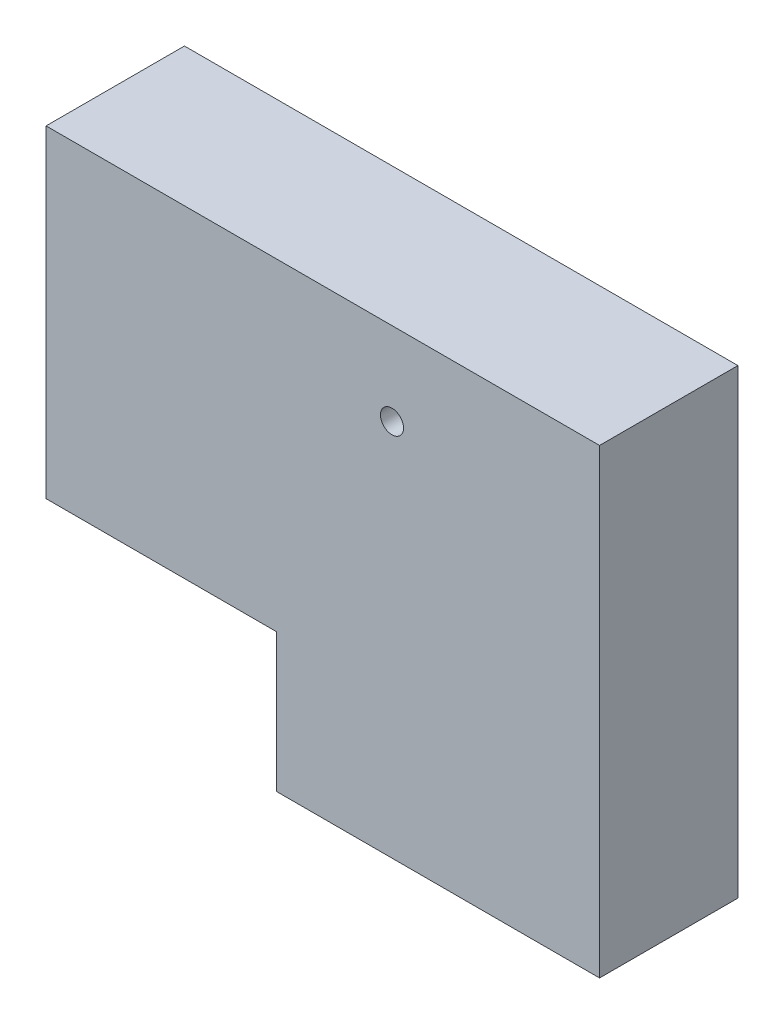
ISO-10303-21;
HEADER;
FILE_DESCRIPTION(('STEP AP214'),'2;1');
FILE_NAME('part.step','',(''),(''),'','','');
FILE_SCHEMA(('AUTOMOTIVE_DESIGN { 1 0 10303 214 1 1 1 1 }'));
ENDSEC;
DATA;
#1=APPLICATION_CONTEXT('core data for automotive mechanical design processes');
#2=APPLICATION_PROTOCOL_DEFINITION('international standard','automotive_design',2000,#1);
#3=PRODUCT_CONTEXT('',#1,'mechanical');
#4=PRODUCT('Part','Part','',(#3));
#5=PRODUCT_RELATED_PRODUCT_CATEGORY('part','',(#4));
#6=PRODUCT_DEFINITION_FORMATION('','',#4);
#7=PRODUCT_DEFINITION_CONTEXT('part definition',#1,'design');
#8=PRODUCT_DEFINITION('design','',#6,#7);
#9=PRODUCT_DEFINITION_SHAPE('','',#8);
#10=(LENGTH_UNIT() NAMED_UNIT(*) SI_UNIT(.MILLI.,.METRE.));
#11=(NAMED_UNIT(*) PLANE_ANGLE_UNIT() SI_UNIT($,.RADIAN.));
#12=(NAMED_UNIT(*) SI_UNIT($,.STERADIAN.) SOLID_ANGLE_UNIT());
#13=UNCERTAINTY_MEASURE_WITH_UNIT(LENGTH_MEASURE(1.E-05),#10,'distance_accuracy_value','');
#14=(GEOMETRIC_REPRESENTATION_CONTEXT(3) GLOBAL_UNCERTAINTY_ASSIGNED_CONTEXT((#13)) GLOBAL_UNIT_ASSIGNED_CONTEXT((#10,
#11,#12)) REPRESENTATION_CONTEXT('',''));
#15=CARTESIAN_POINT('',(0.,0.,0.));
#16=DIRECTION('',(0.,0.,1.));
#17=DIRECTION('',(1.,0.,0.));
#18=AXIS2_PLACEMENT_3D('',#15,#16,#17);
#19=CARTESIAN_POINT('',(-120.,0.,30.));
#20=DIRECTION('',(1.,0.,0.));
#21=DIRECTION('',(0.,1.,0.));
#22=AXIS2_PLACEMENT_3D('',#19,#20,#21);
#23=PLANE('',#22);
#24=DIRECTION('',(0.,-1.,0.));
#25=VECTOR('',#24,1.);
#26=CARTESIAN_POINT('',(-120.,0.,0.));
#27=LINE('',#26,#25);
#28=CARTESIAN_POINT('',(-120.,0.,0.));
#29=VERTEX_POINT('',#28);
#30=CARTESIAN_POINT('',(-120.,-70.,0.));
#31=VERTEX_POINT('',#30);
#32=EDGE_CURVE('E125',#29,#31,#27,.T.);
#33=ORIENTED_EDGE('',*,*,#32,.T.);
#34=DIRECTION('',(0.,0.,-1.));
#35=VECTOR('',#34,1.);
#36=CARTESIAN_POINT('',(-120.,-70.,30.));
#37=LINE('',#36,#35);
#38=CARTESIAN_POINT('',(-120.,-70.,30.));
#39=VERTEX_POINT('',#38);
#40=EDGE_CURVE('E11',#39,#31,#37,.T.);
#41=ORIENTED_EDGE('',*,*,#40,.F.);
#42=DIRECTION('',(0.,-1.,0.));
#43=VECTOR('',#42,1.);
#44=CARTESIAN_POINT('',(-120.,0.,30.));
#45=LINE('',#44,#43);
#46=CARTESIAN_POINT('',(-120.,0.,30.));
#47=VERTEX_POINT('',#46);
#48=EDGE_CURVE('E136',#47,#39,#45,.T.);
#49=ORIENTED_EDGE('',*,*,#48,.F.);
#50=DIRECTION('',(0.,0.,-1.));
#51=VECTOR('',#50,1.);
#52=CARTESIAN_POINT('',(-120.,0.,30.));
#53=LINE('',#52,#51);
#54=EDGE_CURVE('E121',#47,#29,#53,.T.);
#55=ORIENTED_EDGE('',*,*,#54,.T.);
#56=EDGE_LOOP('',(#33,#41,#49,#55));
#57=FACE_BOUND('',#56,.T.);
#58=ADVANCED_FACE('F39',(#57),#23,.F.);
#59=CARTESIAN_POINT('',(-120.,-70.,30.));
#60=DIRECTION('',(0.,1.,0.));
#61=DIRECTION('',(0.,0.,1.));
#62=AXIS2_PLACEMENT_3D('',#59,#60,#61);
#63=PLANE('',#62);
#64=DIRECTION('',(1.,0.,0.));
#65=VECTOR('',#64,1.);
#66=CARTESIAN_POINT('',(-120.,-70.,0.));
#67=LINE('',#66,#65);
#68=CARTESIAN_POINT('',(-70.,-70.,0.));
#69=VERTEX_POINT('',#68);
#70=EDGE_CURVE('E128',#31,#69,#67,.T.);
#71=ORIENTED_EDGE('',*,*,#70,.T.);
#72=DIRECTION('',(0.,0.,-1.));
#73=VECTOR('',#72,1.);
#74=CARTESIAN_POINT('',(-70.,-70.,30.));
#75=LINE('',#74,#73);
#76=CARTESIAN_POINT('',(-70.,-70.,30.));
#77=VERTEX_POINT('',#76);
#78=EDGE_CURVE('E47',#77,#69,#75,.T.);
#79=ORIENTED_EDGE('',*,*,#78,.F.);
#80=DIRECTION('',(1.,0.,0.));
#81=VECTOR('',#80,1.);
#82=CARTESIAN_POINT('',(-120.,-70.,30.));
#83=LINE('',#82,#81);
#84=EDGE_CURVE('E93',#39,#77,#83,.T.);
#85=ORIENTED_EDGE('',*,*,#84,.F.);
#86=ORIENTED_EDGE('',*,*,#40,.T.);
#87=EDGE_LOOP('',(#71,#79,#85,#86));
#88=FACE_BOUND('',#87,.T.);
#89=ADVANCED_FACE('F161',(#88),#63,.F.);
#90=CARTESIAN_POINT('',(-70.,-70.,30.));
#91=DIRECTION('',(1.,0.,0.));
#92=DIRECTION('',(0.,0.,-1.));
#93=AXIS2_PLACEMENT_3D('',#90,#91,#92);
#94=PLANE('',#93);
#95=DIRECTION('',(0.,-1.,0.));
#96=VECTOR('',#95,1.);
#97=CARTESIAN_POINT('',(-70.,-70.,0.));
#98=LINE('',#97,#96);
#99=CARTESIAN_POINT('',(-70.,-100.,0.));
#100=VERTEX_POINT('',#99);
#101=EDGE_CURVE('E131',#69,#100,#98,.T.);
#102=ORIENTED_EDGE('',*,*,#101,.T.);
#103=DIRECTION('',(0.,0.,-1.));
#104=VECTOR('',#103,1.);
#105=CARTESIAN_POINT('',(-70.,-100.,30.));
#106=LINE('',#105,#104);
#107=CARTESIAN_POINT('',(-70.,-100.,30.));
#108=VERTEX_POINT('',#107);
#109=EDGE_CURVE('E116',#108,#100,#106,.T.);
#110=ORIENTED_EDGE('',*,*,#109,.F.);
#111=DIRECTION('',(0.,-1.,0.));
#112=VECTOR('',#111,1.);
#113=CARTESIAN_POINT('',(-70.,-70.,30.));
#114=LINE('',#113,#112);
#115=EDGE_CURVE('E107',#77,#108,#114,.T.);
#116=ORIENTED_EDGE('',*,*,#115,.F.);
#117=ORIENTED_EDGE('',*,*,#78,.T.);
#118=EDGE_LOOP('',(#102,#110,#116,#117));
#119=FACE_BOUND('',#118,.T.);
#120=ADVANCED_FACE('F142',(#119),#94,.F.);
#121=CARTESIAN_POINT('',(-70.,-100.,30.));
#122=DIRECTION('',(0.,1.,0.));
#123=DIRECTION('',(0.,0.,1.));
#124=AXIS2_PLACEMENT_3D('',#121,#122,#123);
#125=PLANE('',#124);
#126=DIRECTION('',(1.,0.,0.));
#127=VECTOR('',#126,1.);
#128=CARTESIAN_POINT('',(-70.,-100.,0.));
#129=LINE('',#128,#127);
#130=CARTESIAN_POINT('',(0.,-100.,0.));
#131=VERTEX_POINT('',#130);
#132=EDGE_CURVE('E115',#100,#131,#129,.T.);
#133=ORIENTED_EDGE('',*,*,#132,.T.);
#134=DIRECTION('',(0.,0.,-1.));
#135=VECTOR('',#134,1.);
#136=CARTESIAN_POINT('',(0.,-100.,30.));
#137=LINE('',#136,#135);
#138=CARTESIAN_POINT('',(0.,-100.,30.));
#139=VERTEX_POINT('',#138);
#140=EDGE_CURVE('E112',#139,#131,#137,.T.);
#141=ORIENTED_EDGE('',*,*,#140,.F.);
#142=DIRECTION('',(1.,0.,0.));
#143=VECTOR('',#142,1.);
#144=CARTESIAN_POINT('',(-70.,-100.,30.));
#145=LINE('',#144,#143);
#146=EDGE_CURVE('E101',#108,#139,#145,.T.);
#147=ORIENTED_EDGE('',*,*,#146,.F.);
#148=ORIENTED_EDGE('',*,*,#109,.T.);
#149=EDGE_LOOP('',(#133,#141,#147,#148));
#150=FACE_BOUND('',#149,.T.);
#151=ADVANCED_FACE('F113',(#150),#125,.F.);
#152=CARTESIAN_POINT('',(0.,0.,30.));
#153=DIRECTION('',(-1.,0.,0.));
#154=DIRECTION('',(0.,-1.,0.));
#155=AXIS2_PLACEMENT_3D('',#152,#153,#154);
#156=PLANE('',#155);
#157=DIRECTION('',(0.,1.,0.));
#158=VECTOR('',#157,1.);
#159=CARTESIAN_POINT('',(0.,0.,0.));
#160=LINE('',#159,#158);
#161=CARTESIAN_POINT('',(0.,0.,0.));
#162=VERTEX_POINT('',#161);
#163=EDGE_CURVE('E79',#131,#162,#160,.T.);
#164=ORIENTED_EDGE('',*,*,#163,.T.);
#165=DIRECTION('',(0.,0.,-1.));
#166=VECTOR('',#165,1.);
#167=CARTESIAN_POINT('',(0.,0.,30.));
#168=LINE('',#167,#166);
#169=CARTESIAN_POINT('',(0.,0.,30.));
#170=VERTEX_POINT('',#169);
#171=EDGE_CURVE('E117',#170,#162,#168,.T.);
#172=ORIENTED_EDGE('',*,*,#171,.F.);
#173=DIRECTION('',(0.,1.,0.));
#174=VECTOR('',#173,1.);
#175=CARTESIAN_POINT('',(0.,0.,30.));
#176=LINE('',#175,#174);
#177=EDGE_CURVE('E105',#139,#170,#176,.T.);
#178=ORIENTED_EDGE('',*,*,#177,.F.);
#179=ORIENTED_EDGE('',*,*,#140,.T.);
#180=EDGE_LOOP('',(#164,#172,#178,#179));
#181=FACE_BOUND('',#180,.T.);
#182=ADVANCED_FACE('F119',(#181),#156,.F.);
#183=CARTESIAN_POINT('',(-120.,0.,30.));
#184=DIRECTION('',(0.,-1.,0.));
#185=DIRECTION('',(0.,0.,-1.));
#186=AXIS2_PLACEMENT_3D('',#183,#184,#185);
#187=PLANE('',#186);
#188=DIRECTION('',(-1.,0.,0.));
#189=VECTOR('',#188,1.);
#190=CARTESIAN_POINT('',(-120.,0.,0.));
#191=LINE('',#190,#189);
#192=EDGE_CURVE('E85',#162,#29,#191,.T.);
#193=ORIENTED_EDGE('',*,*,#192,.T.);
#194=ORIENTED_EDGE('',*,*,#54,.F.);
#195=DIRECTION('',(-1.,0.,0.));
#196=VECTOR('',#195,1.);
#197=CARTESIAN_POINT('',(-120.,0.,30.));
#198=LINE('',#197,#196);
#199=EDGE_CURVE('E55',#170,#47,#198,.T.);
#200=ORIENTED_EDGE('',*,*,#199,.F.);
#201=ORIENTED_EDGE('',*,*,#171,.T.);
#202=EDGE_LOOP('',(#193,#194,#200,#201));
#203=FACE_BOUND('',#202,.T.);
#204=ADVANCED_FACE('F149',(#203),#187,.F.);
#205=CARTESIAN_POINT('',(0.,0.,30.));
#206=DIRECTION('',(0.,0.,1.));
#207=DIRECTION('',(1.,0.,0.));
#208=AXIS2_PLACEMENT_3D('',#205,#206,#207);
#209=PLANE('',#208);
#210=CARTESIAN_POINT('',(-45.,-18.,30.));
#211=DIRECTION('',(0.,0.,1.));
#212=DIRECTION('',(1.,0.,0.));
#213=AXIS2_PLACEMENT_3D('',#210,#211,#212);
#214=CIRCLE('',#213,2.5);
#215=CARTESIAN_POINT('',(-42.5,-18.,30.));
#216=VERTEX_POINT('',#215);
#217=EDGE_CURVE('E229',#216,#216,#214,.T.);
#218=ORIENTED_EDGE('',*,*,#217,.F.);
#219=EDGE_LOOP('',(#218));
#220=FACE_BOUND('',#219,.T.);
#221=ORIENTED_EDGE('',*,*,#48,.T.);
#222=ORIENTED_EDGE('',*,*,#84,.T.);
#223=ORIENTED_EDGE('',*,*,#115,.T.);
#224=ORIENTED_EDGE('',*,*,#146,.T.);
#225=ORIENTED_EDGE('',*,*,#177,.T.);
#226=ORIENTED_EDGE('',*,*,#199,.T.);
#227=EDGE_LOOP('',(#221,#222,#223,#224,#225,#226));
#228=FACE_BOUND('',#227,.T.);
#229=ADVANCED_FACE('F103',(#220,#228),#209,.T.);
#230=CARTESIAN_POINT('',(0.,0.,0.));
#231=DIRECTION('',(0.,0.,1.));
#232=DIRECTION('',(1.,0.,0.));
#233=AXIS2_PLACEMENT_3D('',#230,#231,#232);
#234=PLANE('',#233);
#235=ORIENTED_EDGE('',*,*,#32,.F.);
#236=ORIENTED_EDGE('',*,*,#192,.F.);
#237=ORIENTED_EDGE('',*,*,#163,.F.);
#238=ORIENTED_EDGE('',*,*,#132,.F.);
#239=ORIENTED_EDGE('',*,*,#101,.F.);
#240=ORIENTED_EDGE('',*,*,#70,.F.);
#241=EDGE_LOOP('',(#235,#236,#237,#238,#239,#240));
#242=FACE_BOUND('',#241,.T.);
#243=ADVANCED_FACE('F145',(#242),#234,.F.);
#244=CARTESIAN_POINT('',(-45.,-18.,21.));
#245=DIRECTION('',(0.,0.,1.));
#246=DIRECTION('',(1.,0.,0.));
#247=AXIS2_PLACEMENT_3D('',#244,#245,#246);
#248=CONICAL_SURFACE('',#247,2.5,1.02974425867665);
#249=CARTESIAN_POINT('',(-45.,-18.,19.4978484524311));
#250=VERTEX_POINT('',#249);
#251=VERTEX_LOOP('',#250);
#252=FACE_BOUND('',#251,.T.);
#253=CARTESIAN_POINT('',(-45.,-18.,21.));
#254=DIRECTION('',(0.,0.,1.));
#255=DIRECTION('',(1.,0.,0.));
#256=AXIS2_PLACEMENT_3D('',#253,#254,#255);
#257=CIRCLE('',#256,2.5);
#258=CARTESIAN_POINT('',(-42.5,-18.,21.));
#259=VERTEX_POINT('',#258);
#260=EDGE_CURVE('E129',#259,#259,#257,.T.);
#261=ORIENTED_EDGE('',*,*,#260,.T.);
#262=EDGE_LOOP('',(#261));
#263=FACE_BOUND('',#262,.T.);
#264=ADVANCED_FACE('F193',(#252,#263),#248,.F.);
#265=CARTESIAN_POINT('',(-45.,-18.,30.));
#266=DIRECTION('',(0.,0.,1.));
#267=DIRECTION('',(1.,0.,0.));
#268=AXIS2_PLACEMENT_3D('',#265,#266,#267);
#269=CYLINDRICAL_SURFACE('',#268,2.5);
#270=ORIENTED_EDGE('',*,*,#260,.F.);
#271=EDGE_LOOP('',(#270));
#272=FACE_BOUND('',#271,.T.);
#273=ORIENTED_EDGE('',*,*,#217,.T.);
#274=EDGE_LOOP('',(#273));
#275=FACE_BOUND('',#274,.T.);
#276=ADVANCED_FACE('F206',(#272,#275),#269,.F.);
#277=CLOSED_SHELL('',(#58,#89,#120,#151,#182,#204,#229,#243,#264,#276));
#278=MANIFOLD_SOLID_BREP('B2',#277);
#279=ADVANCED_BREP_SHAPE_REPRESENTATION('',(#18,#278),#14);
#280=SHAPE_DEFINITION_REPRESENTATION(#9,#279);
ENDSEC;
END-ISO-10303-21;
